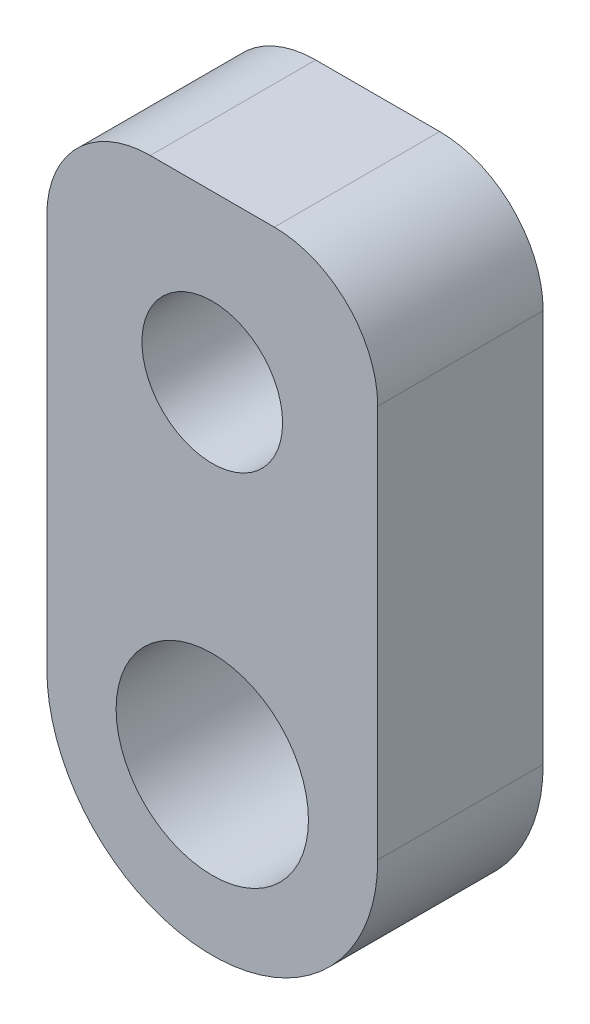
ISO-10303-21;
HEADER;
FILE_DESCRIPTION(('STEP AP214'),'2;1');
FILE_NAME('part.step','',(''),(''),'','','');
FILE_SCHEMA(('AUTOMOTIVE_DESIGN { 1 0 10303 214 1 1 1 1 }'));
ENDSEC;
DATA;
#1=APPLICATION_CONTEXT('core data for automotive mechanical design processes');
#2=APPLICATION_PROTOCOL_DEFINITION('international standard','automotive_design',2000,#1);
#3=PRODUCT_CONTEXT('',#1,'mechanical');
#4=PRODUCT('Part','Part','',(#3));
#5=PRODUCT_RELATED_PRODUCT_CATEGORY('part','',(#4));
#6=PRODUCT_DEFINITION_FORMATION('','',#4);
#7=PRODUCT_DEFINITION_CONTEXT('part definition',#1,'design');
#8=PRODUCT_DEFINITION('design','',#6,#7);
#9=PRODUCT_DEFINITION_SHAPE('','',#8);
#10=(LENGTH_UNIT() NAMED_UNIT(*) SI_UNIT(.MILLI.,.METRE.));
#11=(NAMED_UNIT(*) PLANE_ANGLE_UNIT() SI_UNIT($,.RADIAN.));
#12=(NAMED_UNIT(*) SI_UNIT($,.STERADIAN.) SOLID_ANGLE_UNIT());
#13=UNCERTAINTY_MEASURE_WITH_UNIT(LENGTH_MEASURE(1.E-05),#10,'distance_accuracy_value','');
#14=(GEOMETRIC_REPRESENTATION_CONTEXT(3) GLOBAL_UNCERTAINTY_ASSIGNED_CONTEXT((#13)) GLOBAL_UNIT_ASSIGNED_CONTEXT((#10,
#11,#12)) REPRESENTATION_CONTEXT('',''));
#15=CARTESIAN_POINT('',(0.,0.,0.));
#16=DIRECTION('',(0.,0.,1.));
#17=DIRECTION('',(1.,0.,0.));
#18=AXIS2_PLACEMENT_3D('',#15,#16,#17);
#19=CARTESIAN_POINT('',(0.,0.,4.));
#20=DIRECTION('',(0.,0.,1.));
#21=DIRECTION('',(1.,0.,0.));
#22=AXIS2_PLACEMENT_3D('',#19,#20,#21);
#23=PLANE('',#22);
#24=CARTESIAN_POINT('',(0.,0.,4.));
#25=DIRECTION('',(0.,0.,1.));
#26=DIRECTION('',(1.,0.,0.));
#27=AXIS2_PLACEMENT_3D('',#24,#25,#26);
#28=CIRCLE('',#27,2.325);
#29=CARTESIAN_POINT('',(2.325,0.,4.));
#30=VERTEX_POINT('',#29);
#31=EDGE_CURVE('E97',#30,#30,#28,.T.);
#32=ORIENTED_EDGE('',*,*,#31,.F.);
#33=EDGE_LOOP('',(#32));
#34=FACE_BOUND('',#33,.T.);
#35=DIRECTION('',(0.,1.,0.));
#36=VECTOR('',#35,1.);
#37=CARTESIAN_POINT('',(4.,12.,4.));
#38=LINE('',#37,#36);
#39=CARTESIAN_POINT('',(4.,0.,4.));
#40=VERTEX_POINT('',#39);
#41=CARTESIAN_POINT('',(4.,9.50000000000001,4.));
#42=VERTEX_POINT('',#41);
#43=EDGE_CURVE('E131',#40,#42,#38,.T.);
#44=ORIENTED_EDGE('',*,*,#43,.T.);
#45=CARTESIAN_POINT('',(1.5,9.50000000000001,4.));
#46=DIRECTION('',(0.,0.,1.));
#47=DIRECTION('',(1.,0.,0.));
#48=AXIS2_PLACEMENT_3D('',#45,#46,#47);
#49=CIRCLE('',#48,2.5);
#50=CARTESIAN_POINT('',(1.5,12.,4.));
#51=VERTEX_POINT('',#50);
#52=EDGE_CURVE('E41',#42,#51,#49,.T.);
#53=ORIENTED_EDGE('',*,*,#52,.T.);
#54=DIRECTION('',(-1.,0.,0.));
#55=VECTOR('',#54,1.);
#56=CARTESIAN_POINT('',(-4.,12.,4.));
#57=LINE('',#56,#55);
#58=CARTESIAN_POINT('',(-1.5,12.,4.));
#59=VERTEX_POINT('',#58);
#60=EDGE_CURVE('E113',#51,#59,#57,.T.);
#61=ORIENTED_EDGE('',*,*,#60,.T.);
#62=CARTESIAN_POINT('',(-1.5,9.5,4.));
#63=DIRECTION('',(0.,0.,1.));
#64=DIRECTION('',(1.,0.,0.));
#65=AXIS2_PLACEMENT_3D('',#62,#63,#64);
#66=CIRCLE('',#65,2.5);
#67=CARTESIAN_POINT('',(-4.,9.5,4.));
#68=VERTEX_POINT('',#67);
#69=EDGE_CURVE('E48',#59,#68,#66,.T.);
#70=ORIENTED_EDGE('',*,*,#69,.T.);
#71=DIRECTION('',(0.,-1.,0.));
#72=VECTOR('',#71,1.);
#73=CARTESIAN_POINT('',(-4.,12.,4.));
#74=LINE('',#73,#72);
#75=CARTESIAN_POINT('',(-4.,0.,4.));
#76=VERTEX_POINT('',#75);
#77=EDGE_CURVE('E143',#68,#76,#74,.T.);
#78=ORIENTED_EDGE('',*,*,#77,.T.);
#79=CARTESIAN_POINT('',(0.,0.,4.));
#80=DIRECTION('',(0.,0.,1.));
#81=DIRECTION('',(1.,0.,0.));
#82=AXIS2_PLACEMENT_3D('',#79,#80,#81);
#83=CIRCLE('',#82,4.);
#84=EDGE_CURVE('E106',#76,#40,#83,.T.);
#85=ORIENTED_EDGE('',*,*,#84,.T.);
#86=EDGE_LOOP('',(#44,#53,#61,#70,#78,#85));
#87=FACE_BOUND('',#86,.T.);
#88=CARTESIAN_POINT('',(0.,8.,4.));
#89=DIRECTION('',(0.,0.,1.));
#90=DIRECTION('',(1.,0.,0.));
#91=AXIS2_PLACEMENT_3D('',#88,#89,#90);
#92=CIRCLE('',#91,1.7);
#93=CARTESIAN_POINT('',(1.7,8.,4.));
#94=VERTEX_POINT('',#93);
#95=EDGE_CURVE('E150',#94,#94,#92,.T.);
#96=ORIENTED_EDGE('',*,*,#95,.F.);
#97=EDGE_LOOP('',(#96));
#98=FACE_BOUND('',#97,.T.);
#99=ADVANCED_FACE('F33',(#34,#87,#98),#23,.T.);
#100=CARTESIAN_POINT('',(0.,0.,0.));
#101=DIRECTION('',(0.,0.,1.));
#102=DIRECTION('',(1.,0.,0.));
#103=AXIS2_PLACEMENT_3D('',#100,#101,#102);
#104=PLANE('',#103);
#105=CARTESIAN_POINT('',(0.,0.,0.));
#106=DIRECTION('',(0.,0.,1.));
#107=DIRECTION('',(1.,0.,0.));
#108=AXIS2_PLACEMENT_3D('',#105,#106,#107);
#109=CIRCLE('',#108,2.325);
#110=CARTESIAN_POINT('',(2.325,0.,0.));
#111=VERTEX_POINT('',#110);
#112=EDGE_CURVE('E147',#111,#111,#109,.T.);
#113=ORIENTED_EDGE('',*,*,#112,.T.);
#114=EDGE_LOOP('',(#113));
#115=FACE_BOUND('',#114,.T.);
#116=DIRECTION('',(-1.,0.,0.));
#117=VECTOR('',#116,1.);
#118=CARTESIAN_POINT('',(-4.,12.,0.));
#119=LINE('',#118,#117);
#120=CARTESIAN_POINT('',(1.5,12.,0.));
#121=VERTEX_POINT('',#120);
#122=CARTESIAN_POINT('',(-1.5,12.,0.));
#123=VERTEX_POINT('',#122);
#124=EDGE_CURVE('E140',#121,#123,#119,.T.);
#125=ORIENTED_EDGE('',*,*,#124,.F.);
#126=CARTESIAN_POINT('',(1.5,9.50000000000001,0.));
#127=DIRECTION('',(0.,0.,1.));
#128=DIRECTION('',(1.,0.,0.));
#129=AXIS2_PLACEMENT_3D('',#126,#127,#128);
#130=CIRCLE('',#129,2.5);
#131=CARTESIAN_POINT('',(4.,9.50000000000001,0.));
#132=VERTEX_POINT('',#131);
#133=EDGE_CURVE('E125',#121,#132,#130,.F.);
#134=ORIENTED_EDGE('',*,*,#133,.T.);
#135=DIRECTION('',(0.,1.,0.));
#136=VECTOR('',#135,1.);
#137=CARTESIAN_POINT('',(4.,12.,0.));
#138=LINE('',#137,#136);
#139=CARTESIAN_POINT('',(4.,0.,0.));
#140=VERTEX_POINT('',#139);
#141=EDGE_CURVE('E96',#140,#132,#138,.T.);
#142=ORIENTED_EDGE('',*,*,#141,.F.);
#143=CARTESIAN_POINT('',(0.,0.,0.));
#144=DIRECTION('',(0.,0.,1.));
#145=DIRECTION('',(1.,0.,0.));
#146=AXIS2_PLACEMENT_3D('',#143,#144,#145);
#147=CIRCLE('',#146,4.);
#148=CARTESIAN_POINT('',(-4.,0.,0.));
#149=VERTEX_POINT('',#148);
#150=EDGE_CURVE('E100',#149,#140,#147,.T.);
#151=ORIENTED_EDGE('',*,*,#150,.F.);
#152=DIRECTION('',(0.,-1.,0.));
#153=VECTOR('',#152,1.);
#154=CARTESIAN_POINT('',(-4.,12.,0.));
#155=LINE('',#154,#153);
#156=CARTESIAN_POINT('',(-4.,9.5,0.));
#157=VERTEX_POINT('',#156);
#158=EDGE_CURVE('E89',#157,#149,#155,.T.);
#159=ORIENTED_EDGE('',*,*,#158,.F.);
#160=CARTESIAN_POINT('',(-1.5,9.5,0.));
#161=DIRECTION('',(0.,0.,1.));
#162=DIRECTION('',(1.,0.,0.));
#163=AXIS2_PLACEMENT_3D('',#160,#161,#162);
#164=CIRCLE('',#163,2.5);
#165=EDGE_CURVE('E123',#157,#123,#164,.F.);
#166=ORIENTED_EDGE('',*,*,#165,.T.);
#167=EDGE_LOOP('',(#125,#134,#142,#151,#159,#166));
#168=FACE_BOUND('',#167,.T.);
#169=CARTESIAN_POINT('',(0.,8.,0.));
#170=DIRECTION('',(0.,0.,1.));
#171=DIRECTION('',(1.,0.,0.));
#172=AXIS2_PLACEMENT_3D('',#169,#170,#171);
#173=CIRCLE('',#172,1.7);
#174=CARTESIAN_POINT('',(1.7,8.,0.));
#175=VERTEX_POINT('',#174);
#176=EDGE_CURVE('E153',#175,#175,#173,.T.);
#177=ORIENTED_EDGE('',*,*,#176,.T.);
#178=EDGE_LOOP('',(#177));
#179=FACE_BOUND('',#178,.T.);
#180=ADVANCED_FACE('F102',(#115,#168,#179),#104,.F.);
#181=CARTESIAN_POINT('',(0.,0.,4.));
#182=DIRECTION('',(0.,0.,-1.));
#183=DIRECTION('',(-1.,0.,0.));
#184=AXIS2_PLACEMENT_3D('',#181,#182,#183);
#185=CYLINDRICAL_SURFACE('',#184,4.);
#186=DIRECTION('',(0.,0.,-1.));
#187=VECTOR('',#186,1.);
#188=CARTESIAN_POINT('',(-4.,0.,4.));
#189=LINE('',#188,#187);
#190=EDGE_CURVE('E93',#76,#149,#189,.T.);
#191=ORIENTED_EDGE('',*,*,#190,.T.);
#192=ORIENTED_EDGE('',*,*,#150,.T.);
#193=DIRECTION('',(0.,0.,-1.));
#194=VECTOR('',#193,1.);
#195=CARTESIAN_POINT('',(4.,0.,4.));
#196=LINE('',#195,#194);
#197=EDGE_CURVE('E111',#40,#140,#196,.T.);
#198=ORIENTED_EDGE('',*,*,#197,.F.);
#199=ORIENTED_EDGE('',*,*,#84,.F.);
#200=EDGE_LOOP('',(#191,#192,#198,#199));
#201=FACE_BOUND('',#200,.T.);
#202=ADVANCED_FACE('F109',(#201),#185,.T.);
#203=CARTESIAN_POINT('',(-4.,12.,4.));
#204=DIRECTION('',(1.,0.,0.));
#205=DIRECTION('',(0.,1.,0.));
#206=AXIS2_PLACEMENT_3D('',#203,#204,#205);
#207=PLANE('',#206);
#208=ORIENTED_EDGE('',*,*,#77,.F.);
#209=DIRECTION('',(0.,0.,-1.));
#210=VECTOR('',#209,1.);
#211=CARTESIAN_POINT('',(-4.,9.5,4.));
#212=LINE('',#211,#210);
#213=EDGE_CURVE('E11',#68,#157,#212,.T.);
#214=ORIENTED_EDGE('',*,*,#213,.T.);
#215=ORIENTED_EDGE('',*,*,#158,.T.);
#216=ORIENTED_EDGE('',*,*,#190,.F.);
#217=EDGE_LOOP('',(#208,#214,#215,#216));
#218=FACE_BOUND('',#217,.T.);
#219=ADVANCED_FACE('F91',(#218),#207,.F.);
#220=CARTESIAN_POINT('',(4.,12.,4.));
#221=DIRECTION('',(-1.,0.,0.));
#222=DIRECTION('',(0.,-1.,0.));
#223=AXIS2_PLACEMENT_3D('',#220,#221,#222);
#224=PLANE('',#223);
#225=ORIENTED_EDGE('',*,*,#141,.T.);
#226=DIRECTION('',(0.,0.,-1.));
#227=VECTOR('',#226,1.);
#228=CARTESIAN_POINT('',(4.,9.50000000000001,4.));
#229=LINE('',#228,#227);
#230=EDGE_CURVE('E56',#132,#42,#229,.F.);
#231=ORIENTED_EDGE('',*,*,#230,.T.);
#232=ORIENTED_EDGE('',*,*,#43,.F.);
#233=ORIENTED_EDGE('',*,*,#197,.T.);
#234=EDGE_LOOP('',(#225,#231,#232,#233));
#235=FACE_BOUND('',#234,.T.);
#236=ADVANCED_FACE('F141',(#235),#224,.F.);
#237=CARTESIAN_POINT('',(-4.,12.,4.));
#238=DIRECTION('',(0.,-1.,0.));
#239=DIRECTION('',(1.,0.,0.));
#240=AXIS2_PLACEMENT_3D('',#237,#238,#239);
#241=PLANE('',#240);
#242=ORIENTED_EDGE('',*,*,#60,.F.);
#243=DIRECTION('',(0.,0.,-1.));
#244=VECTOR('',#243,1.);
#245=CARTESIAN_POINT('',(1.5,12.,4.));
#246=LINE('',#245,#244);
#247=EDGE_CURVE('E120',#51,#121,#246,.T.);
#248=ORIENTED_EDGE('',*,*,#247,.T.);
#249=ORIENTED_EDGE('',*,*,#124,.T.);
#250=DIRECTION('',(0.,0.,-1.));
#251=VECTOR('',#250,1.);
#252=CARTESIAN_POINT('',(-1.5,12.,4.));
#253=LINE('',#252,#251);
#254=EDGE_CURVE('E117',#123,#59,#253,.F.);
#255=ORIENTED_EDGE('',*,*,#254,.T.);
#256=EDGE_LOOP('',(#242,#248,#249,#255));
#257=FACE_BOUND('',#256,.T.);
#258=ADVANCED_FACE('F135',(#257),#241,.F.);
#259=CARTESIAN_POINT('',(0.,0.,4.));
#260=DIRECTION('',(0.,0.,-1.));
#261=DIRECTION('',(-1.,0.,0.));
#262=AXIS2_PLACEMENT_3D('',#259,#260,#261);
#263=CYLINDRICAL_SURFACE('',#262,2.325);
#264=ORIENTED_EDGE('',*,*,#31,.T.);
#265=EDGE_LOOP('',(#264));
#266=FACE_BOUND('',#265,.T.);
#267=ORIENTED_EDGE('',*,*,#112,.F.);
#268=EDGE_LOOP('',(#267));
#269=FACE_BOUND('',#268,.T.);
#270=ADVANCED_FACE('F180',(#266,#269),#263,.F.);
#271=CARTESIAN_POINT('',(0.,8.,4.));
#272=DIRECTION('',(0.,0.,-1.));
#273=DIRECTION('',(-1.,0.,0.));
#274=AXIS2_PLACEMENT_3D('',#271,#272,#273);
#275=CYLINDRICAL_SURFACE('',#274,1.7);
#276=ORIENTED_EDGE('',*,*,#95,.T.);
#277=EDGE_LOOP('',(#276));
#278=FACE_BOUND('',#277,.T.);
#279=ORIENTED_EDGE('',*,*,#176,.F.);
#280=EDGE_LOOP('',(#279));
#281=FACE_BOUND('',#280,.T.);
#282=ADVANCED_FACE('F159',(#278,#281),#275,.F.);
#283=CARTESIAN_POINT('',(1.5,9.50000000000001,4.));
#284=DIRECTION('',(0.,0.,-1.));
#285=DIRECTION('',(-1.,0.,0.));
#286=AXIS2_PLACEMENT_3D('',#283,#284,#285);
#287=CYLINDRICAL_SURFACE('',#286,2.5);
#288=ORIENTED_EDGE('',*,*,#52,.F.);
#289=ORIENTED_EDGE('',*,*,#230,.F.);
#290=ORIENTED_EDGE('',*,*,#133,.F.);
#291=ORIENTED_EDGE('',*,*,#247,.F.);
#292=EDGE_LOOP('',(#288,#289,#290,#291));
#293=FACE_BOUND('',#292,.T.);
#294=ADVANCED_FACE('F139',(#293),#287,.T.);
#295=CARTESIAN_POINT('',(-1.5,9.5,4.));
#296=DIRECTION('',(0.,0.,-1.));
#297=DIRECTION('',(-1.,0.,0.));
#298=AXIS2_PLACEMENT_3D('',#295,#296,#297);
#299=CYLINDRICAL_SURFACE('',#298,2.5);
#300=ORIENTED_EDGE('',*,*,#69,.F.);
#301=ORIENTED_EDGE('',*,*,#254,.F.);
#302=ORIENTED_EDGE('',*,*,#165,.F.);
#303=ORIENTED_EDGE('',*,*,#213,.F.);
#304=EDGE_LOOP('',(#300,#301,#302,#303));
#305=FACE_BOUND('',#304,.T.);
#306=ADVANCED_FACE('F35',(#305),#299,.T.);
#307=CLOSED_SHELL('',(#99,#180,#202,#219,#236,#258,#270,#282,#294,#306));
#308=MANIFOLD_SOLID_BREP('B2',#307);
#309=ADVANCED_BREP_SHAPE_REPRESENTATION('',(#18,#308),#14);
#310=SHAPE_DEFINITION_REPRESENTATION(#9,#309);
ENDSEC;
END-ISO-10303-21;
